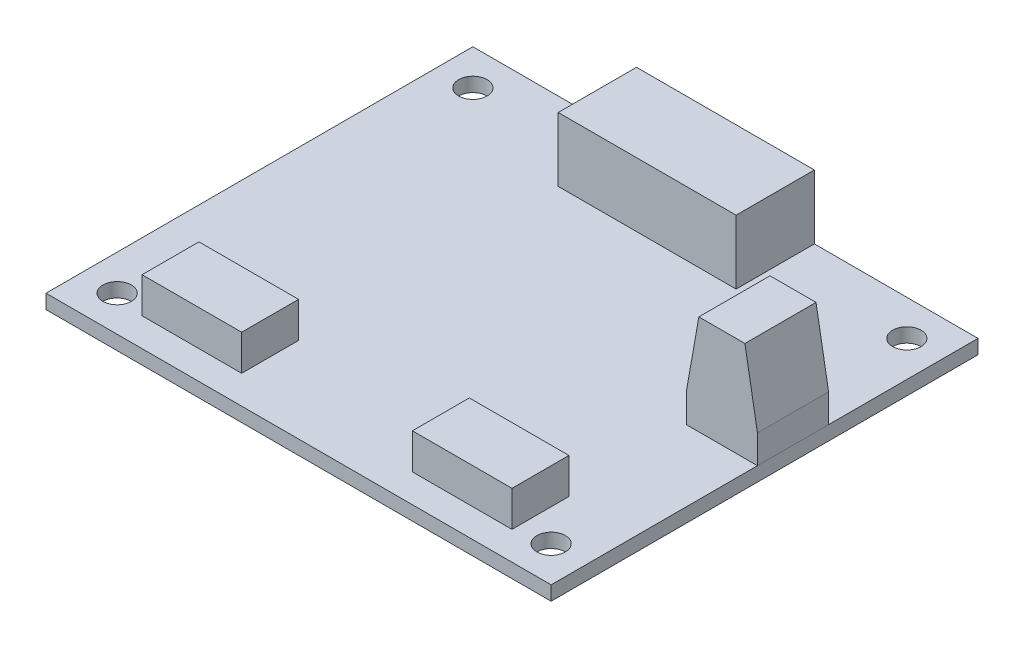
ISO-10303-21;
HEADER;
FILE_DESCRIPTION(('STEP AP214'),'2;1');
FILE_NAME('part.step','',(''),(''),'','','');
FILE_SCHEMA(('AUTOMOTIVE_DESIGN { 1 0 10303 214 1 1 1 1 }'));
ENDSEC;
DATA;
#1=APPLICATION_CONTEXT('core data for automotive mechanical design processes');
#2=APPLICATION_PROTOCOL_DEFINITION('international standard','automotive_design',2000,#1);
#3=PRODUCT_CONTEXT('',#1,'mechanical');
#4=PRODUCT('Part','Part','',(#3));
#5=PRODUCT_RELATED_PRODUCT_CATEGORY('part','',(#4));
#6=PRODUCT_DEFINITION_FORMATION('','',#4);
#7=PRODUCT_DEFINITION_CONTEXT('part definition',#1,'design');
#8=PRODUCT_DEFINITION('design','',#6,#7);
#9=PRODUCT_DEFINITION_SHAPE('','',#8);
#10=(LENGTH_UNIT() NAMED_UNIT(*) SI_UNIT(.MILLI.,.METRE.));
#11=(NAMED_UNIT(*) PLANE_ANGLE_UNIT() SI_UNIT($,.RADIAN.));
#12=(NAMED_UNIT(*) SI_UNIT($,.STERADIAN.) SOLID_ANGLE_UNIT());
#13=UNCERTAINTY_MEASURE_WITH_UNIT(LENGTH_MEASURE(1.E-05),#10,'distance_accuracy_value','');
#14=(GEOMETRIC_REPRESENTATION_CONTEXT(3) GLOBAL_UNCERTAINTY_ASSIGNED_CONTEXT((#13)) GLOBAL_UNIT_ASSIGNED_CONTEXT((#10,
#11,#12)) REPRESENTATION_CONTEXT('',''));
#15=CARTESIAN_POINT('',(0.,0.,0.));
#16=DIRECTION('',(0.,0.,1.));
#17=DIRECTION('',(1.,0.,0.));
#18=AXIS2_PLACEMENT_3D('',#15,#16,#17);
#19=CARTESIAN_POINT('',(0.,16.,-39.));
#20=DIRECTION('',(0.,0.,1.));
#21=DIRECTION('',(1.,0.,0.));
#22=AXIS2_PLACEMENT_3D('',#19,#20,#21);
#23=PLANE('',#22);
#24=DIRECTION('',(0.,-1.,0.));
#25=VECTOR('',#24,1.);
#26=CARTESIAN_POINT('',(61.,16.,-39.));
#27=LINE('',#26,#25);
#28=CARTESIAN_POINT('',(61.,5.99999999999979,-39.));
#29=VERTEX_POINT('',#28);
#30=CARTESIAN_POINT('',(61.,2.,-39.));
#31=VERTEX_POINT('',#30);
#32=EDGE_CURVE('E101',#29,#31,#27,.T.);
#33=ORIENTED_EDGE('',*,*,#32,.F.);
#34=DIRECTION('',(0.173648177666928,0.984807753012208,0.));
#35=VECTOR('',#34,1.);
#36=CARTESIAN_POINT('',(62.7632698070847,16.,-39.));
#37=LINE('',#36,#35);
#38=CARTESIAN_POINT('',(62.7632698070847,16.,-39.));
#39=VERTEX_POINT('',#38);
#40=EDGE_CURVE('E58',#29,#39,#37,.T.);
#41=ORIENTED_EDGE('',*,*,#40,.T.);
#42=DIRECTION('',(-1.,0.,0.));
#43=VECTOR('',#42,1.);
#44=CARTESIAN_POINT('',(0.,16.,-39.));
#45=LINE('',#44,#43);
#46=CARTESIAN_POINT('',(69.2367301929153,16.,-39.));
#47=VERTEX_POINT('',#46);
#48=EDGE_CURVE('E129',#47,#39,#45,.T.);
#49=ORIENTED_EDGE('',*,*,#48,.F.);
#50=DIRECTION('',(0.173648177666927,-0.984807753012209,0.));
#51=VECTOR('',#50,1.);
#52=CARTESIAN_POINT('',(69.2367301929153,16.,-39.));
#53=LINE('',#52,#51);
#54=CARTESIAN_POINT('',(71.,5.9999999999998,-39.));
#55=VERTEX_POINT('',#54);
#56=EDGE_CURVE('E65',#47,#55,#53,.T.);
#57=ORIENTED_EDGE('',*,*,#56,.T.);
#58=DIRECTION('',(0.,-1.,0.));
#59=VECTOR('',#58,1.);
#60=CARTESIAN_POINT('',(71.,16.,-39.));
#61=LINE('',#60,#59);
#62=CARTESIAN_POINT('',(71.,2.,-39.));
#63=VERTEX_POINT('',#62);
#64=EDGE_CURVE('E119',#55,#63,#61,.T.);
#65=ORIENTED_EDGE('',*,*,#64,.T.);
#66=DIRECTION('',(-1.,0.,0.));
#67=VECTOR('',#66,1.);
#68=CARTESIAN_POINT('',(0.,2.,-39.));
#69=LINE('',#68,#67);
#70=EDGE_CURVE('E115',#63,#31,#69,.T.);
#71=ORIENTED_EDGE('',*,*,#70,.T.);
#72=EDGE_LOOP('',(#33,#41,#49,#57,#65,#71));
#73=FACE_BOUND('',#72,.T.);
#74=ADVANCED_FACE('F50',(#73),#23,.F.);
#75=CARTESIAN_POINT('',(61.,16.,0.));
#76=DIRECTION('',(1.,0.,0.));
#77=DIRECTION('',(0.,0.,-1.));
#78=AXIS2_PLACEMENT_3D('',#75,#76,#77);
#79=PLANE('',#78);
#80=DIRECTION('',(0.,-1.,0.));
#81=VECTOR('',#80,1.);
#82=CARTESIAN_POINT('',(61.,16.,-29.));
#83=LINE('',#82,#81);
#84=CARTESIAN_POINT('',(61.,5.99999999999979,-29.));
#85=VERTEX_POINT('',#84);
#86=CARTESIAN_POINT('',(61.,2.,-29.));
#87=VERTEX_POINT('',#86);
#88=EDGE_CURVE('E109',#85,#87,#83,.T.);
#89=ORIENTED_EDGE('',*,*,#88,.F.);
#90=DIRECTION('',(0.,0.,-1.));
#91=VECTOR('',#90,1.);
#92=CARTESIAN_POINT('',(61.,5.99999999999979,-39.));
#93=LINE('',#92,#91);
#94=EDGE_CURVE('E73',#85,#29,#93,.T.);
#95=ORIENTED_EDGE('',*,*,#94,.T.);
#96=ORIENTED_EDGE('',*,*,#32,.T.);
#97=DIRECTION('',(0.,0.,1.));
#98=VECTOR('',#97,1.);
#99=CARTESIAN_POINT('',(61.,2.,0.));
#100=LINE('',#99,#98);
#101=EDGE_CURVE('E104',#31,#87,#100,.T.);
#102=ORIENTED_EDGE('',*,*,#101,.T.);
#103=EDGE_LOOP('',(#89,#95,#96,#102));
#104=FACE_BOUND('',#103,.T.);
#105=ADVANCED_FACE('F103',(#104),#79,.F.);
#106=CARTESIAN_POINT('',(0.,16.,-29.));
#107=DIRECTION('',(0.,0.,1.));
#108=DIRECTION('',(1.,0.,0.));
#109=AXIS2_PLACEMENT_3D('',#106,#107,#108);
#110=PLANE('',#109);
#111=DIRECTION('',(-1.,0.,0.));
#112=VECTOR('',#111,1.);
#113=CARTESIAN_POINT('',(0.,16.,-29.));
#114=LINE('',#113,#112);
#115=CARTESIAN_POINT('',(69.2367301929153,16.,-29.));
#116=VERTEX_POINT('',#115);
#117=CARTESIAN_POINT('',(62.7632698070847,16.,-29.));
#118=VERTEX_POINT('',#117);
#119=EDGE_CURVE('E123',#116,#118,#114,.T.);
#120=ORIENTED_EDGE('',*,*,#119,.T.);
#121=DIRECTION('',(-0.173648177666928,-0.984807753012208,0.));
#122=VECTOR('',#121,1.);
#123=CARTESIAN_POINT('',(60.8707256505986,5.26684873249676,-29.));
#124=LINE('',#123,#122);
#125=EDGE_CURVE('E141',#118,#85,#124,.T.);
#126=ORIENTED_EDGE('',*,*,#125,.T.);
#127=ORIENTED_EDGE('',*,*,#88,.T.);
#128=DIRECTION('',(-1.,0.,0.));
#129=VECTOR('',#128,1.);
#130=CARTESIAN_POINT('',(0.,2.,-29.));
#131=LINE('',#130,#129);
#132=CARTESIAN_POINT('',(71.,2.,-29.));
#133=VERTEX_POINT('',#132);
#134=EDGE_CURVE('E117',#133,#87,#131,.T.);
#135=ORIENTED_EDGE('',*,*,#134,.F.);
#136=DIRECTION('',(0.,-1.,0.));
#137=VECTOR('',#136,1.);
#138=CARTESIAN_POINT('',(71.,16.,-29.));
#139=LINE('',#138,#137);
#140=CARTESIAN_POINT('',(71.,5.9999999999998,-29.));
#141=VERTEX_POINT('',#140);
#142=EDGE_CURVE('E131',#141,#133,#139,.T.);
#143=ORIENTED_EDGE('',*,*,#142,.F.);
#144=DIRECTION('',(-0.173648177666927,0.984807753012209,0.));
#145=VECTOR('',#144,1.);
#146=CARTESIAN_POINT('',(67.1489873212715,27.8401781919905,-29.));
#147=LINE('',#146,#145);
#148=EDGE_CURVE('E139',#141,#116,#147,.T.);
#149=ORIENTED_EDGE('',*,*,#148,.T.);
#150=EDGE_LOOP('',(#120,#126,#127,#135,#143,#149));
#151=FACE_BOUND('',#150,.T.);
#152=ADVANCED_FACE('F154',(#151),#110,.T.);
#153=CARTESIAN_POINT('',(71.,16.,0.));
#154=DIRECTION('',(-1.,0.,0.));
#155=DIRECTION('',(0.,0.,1.));
#156=AXIS2_PLACEMENT_3D('',#153,#154,#155);
#157=PLANE('',#156);
#158=ORIENTED_EDGE('',*,*,#64,.F.);
#159=DIRECTION('',(0.,0.,1.));
#160=VECTOR('',#159,1.);
#161=CARTESIAN_POINT('',(71.,5.9999999999998,-29.));
#162=LINE('',#161,#160);
#163=EDGE_CURVE('E12',#55,#141,#162,.T.);
#164=ORIENTED_EDGE('',*,*,#163,.T.);
#165=ORIENTED_EDGE('',*,*,#142,.T.);
#166=DIRECTION('',(0.,0.,-1.));
#167=VECTOR('',#166,1.);
#168=CARTESIAN_POINT('',(71.,2.,0.));
#169=LINE('',#168,#167);
#170=EDGE_CURVE('E127',#133,#63,#169,.T.);
#171=ORIENTED_EDGE('',*,*,#170,.T.);
#172=EDGE_LOOP('',(#158,#164,#165,#171));
#173=FACE_BOUND('',#172,.T.);
#174=ADVANCED_FACE('F160',(#173),#157,.F.);
#175=CARTESIAN_POINT('',(0.,16.,0.));
#176=DIRECTION('',(0.,1.,0.));
#177=DIRECTION('',(0.,0.,1.));
#178=AXIS2_PLACEMENT_3D('',#175,#176,#177);
#179=PLANE('',#178);
#180=ORIENTED_EDGE('',*,*,#48,.T.);
#181=DIRECTION('',(0.,0.,1.));
#182=VECTOR('',#181,1.);
#183=CARTESIAN_POINT('',(62.7632698070847,16.,-29.));
#184=LINE('',#183,#182);
#185=EDGE_CURVE('E136',#39,#118,#184,.T.);
#186=ORIENTED_EDGE('',*,*,#185,.T.);
#187=ORIENTED_EDGE('',*,*,#119,.F.);
#188=DIRECTION('',(0.,0.,-1.));
#189=VECTOR('',#188,1.);
#190=CARTESIAN_POINT('',(69.2367301929153,16.,-39.));
#191=LINE('',#190,#189);
#192=EDGE_CURVE('E108',#116,#47,#191,.T.);
#193=ORIENTED_EDGE('',*,*,#192,.T.);
#194=EDGE_LOOP('',(#180,#186,#187,#193));
#195=FACE_BOUND('',#194,.T.);
#196=ADVANCED_FACE('F148',(#195),#179,.T.);
#197=CARTESIAN_POINT('',(0.,2.,0.));
#198=DIRECTION('',(0.,1.,0.));
#199=DIRECTION('',(0.,0.,1.));
#200=AXIS2_PLACEMENT_3D('',#197,#198,#199);
#201=PLANE('',#200);
#202=ORIENTED_EDGE('',*,*,#70,.F.);
#203=ORIENTED_EDGE('',*,*,#170,.F.);
#204=ORIENTED_EDGE('',*,*,#134,.T.);
#205=ORIENTED_EDGE('',*,*,#101,.F.);
#206=EDGE_LOOP('',(#202,#203,#204,#205));
#207=FACE_BOUND('',#206,.T.);
#208=ADVANCED_FACE('F113',(#207),#201,.F.);
#209=CARTESIAN_POINT('',(62.7632698070846,16.,0.));
#210=DIRECTION('',(-0.984807753012208,0.173648177666928,0.));
#211=DIRECTION('',(0.,0.,-1.));
#212=AXIS2_PLACEMENT_3D('',#209,#210,#211);
#213=PLANE('',#212);
#214=ORIENTED_EDGE('',*,*,#40,.F.);
#215=ORIENTED_EDGE('',*,*,#94,.F.);
#216=ORIENTED_EDGE('',*,*,#125,.F.);
#217=ORIENTED_EDGE('',*,*,#185,.F.);
#218=EDGE_LOOP('',(#214,#215,#216,#217));
#219=FACE_BOUND('',#218,.T.);
#220=ADVANCED_FACE('F152',(#219),#213,.T.);
#221=CARTESIAN_POINT('',(69.2367301929153,16.,0.));
#222=DIRECTION('',(0.984807753012209,0.173648177666927,0.));
#223=DIRECTION('',(0.,0.,1.));
#224=AXIS2_PLACEMENT_3D('',#221,#222,#223);
#225=PLANE('',#224);
#226=ORIENTED_EDGE('',*,*,#148,.F.);
#227=ORIENTED_EDGE('',*,*,#163,.F.);
#228=ORIENTED_EDGE('',*,*,#56,.F.);
#229=ORIENTED_EDGE('',*,*,#192,.F.);
#230=EDGE_LOOP('',(#226,#227,#228,#229));
#231=FACE_BOUND('',#230,.T.);
#232=ADVANCED_FACE('F52',(#231),#225,.T.);
#233=CLOSED_SHELL('',(#74,#105,#152,#174,#196,#208,#220,#232));
#234=MANIFOLD_SOLID_BREP('B2',#233);
#235=CARTESIAN_POINT('',(48.,11.,0.));
#236=DIRECTION('',(1.,0.,0.));
#237=DIRECTION('',(0.,0.,-1.));
#238=AXIS2_PLACEMENT_3D('',#235,#236,#237);
#239=PLANE('',#238);
#240=DIRECTION('',(0.,0.,1.));
#241=VECTOR('',#240,1.);
#242=CARTESIAN_POINT('',(48.,2.,0.));
#243=LINE('',#242,#241);
#244=CARTESIAN_POINT('',(48.,2.,-60.));
#245=VERTEX_POINT('',#244);
#246=CARTESIAN_POINT('',(48.,2.,-49.));
#247=VERTEX_POINT('',#246);
#248=EDGE_CURVE('E300',#245,#247,#243,.T.);
#249=ORIENTED_EDGE('',*,*,#248,.F.);
#250=DIRECTION('',(0.,-1.,0.));
#251=VECTOR('',#250,1.);
#252=CARTESIAN_POINT('',(48.,11.,-60.));
#253=LINE('',#252,#251);
#254=CARTESIAN_POINT('',(48.,11.,-60.));
#255=VERTEX_POINT('',#254);
#256=EDGE_CURVE('E48',#255,#245,#253,.T.);
#257=ORIENTED_EDGE('',*,*,#256,.F.);
#258=DIRECTION('',(0.,0.,1.));
#259=VECTOR('',#258,1.);
#260=CARTESIAN_POINT('',(48.,11.,0.));
#261=LINE('',#260,#259);
#262=CARTESIAN_POINT('',(48.,11.,-49.));
#263=VERTEX_POINT('',#262);
#264=EDGE_CURVE('E288',#255,#263,#261,.T.);
#265=ORIENTED_EDGE('',*,*,#264,.T.);
#266=DIRECTION('',(0.,-1.,0.));
#267=VECTOR('',#266,1.);
#268=CARTESIAN_POINT('',(48.,11.,-49.));
#269=LINE('',#268,#267);
#270=EDGE_CURVE('E277',#263,#247,#269,.T.);
#271=ORIENTED_EDGE('',*,*,#270,.T.);
#272=EDGE_LOOP('',(#249,#257,#265,#271));
#273=FACE_BOUND('',#272,.T.);
#274=ADVANCED_FACE('F238',(#273),#239,.T.);
#275=CARTESIAN_POINT('',(0.,11.,-60.));
#276=DIRECTION('',(0.,0.,1.));
#277=DIRECTION('',(1.,0.,0.));
#278=AXIS2_PLACEMENT_3D('',#275,#276,#277);
#279=PLANE('',#278);
#280=DIRECTION('',(-1.,0.,0.));
#281=VECTOR('',#280,1.);
#282=CARTESIAN_POINT('',(0.,2.,-60.));
#283=LINE('',#282,#281);
#284=CARTESIAN_POINT('',(23.,2.,-60.));
#285=VERTEX_POINT('',#284);
#286=EDGE_CURVE('E293',#245,#285,#283,.T.);
#287=ORIENTED_EDGE('',*,*,#286,.T.);
#288=DIRECTION('',(0.,-1.,0.));
#289=VECTOR('',#288,1.);
#290=CARTESIAN_POINT('',(23.,11.,-60.));
#291=LINE('',#290,#289);
#292=CARTESIAN_POINT('',(23.,11.,-60.));
#293=VERTEX_POINT('',#292);
#294=EDGE_CURVE('E246',#293,#285,#291,.T.);
#295=ORIENTED_EDGE('',*,*,#294,.F.);
#296=DIRECTION('',(-1.,0.,0.));
#297=VECTOR('',#296,1.);
#298=CARTESIAN_POINT('',(0.,11.,-60.));
#299=LINE('',#298,#297);
#300=EDGE_CURVE('E283',#255,#293,#299,.T.);
#301=ORIENTED_EDGE('',*,*,#300,.F.);
#302=ORIENTED_EDGE('',*,*,#256,.T.);
#303=EDGE_LOOP('',(#287,#295,#301,#302));
#304=FACE_BOUND('',#303,.T.);
#305=ADVANCED_FACE('F291',(#304),#279,.F.);
#306=CARTESIAN_POINT('',(23.,11.,0.));
#307=DIRECTION('',(1.,0.,0.));
#308=DIRECTION('',(0.,0.,-1.));
#309=AXIS2_PLACEMENT_3D('',#306,#307,#308);
#310=PLANE('',#309);
#311=DIRECTION('',(0.,0.,1.));
#312=VECTOR('',#311,1.);
#313=CARTESIAN_POINT('',(23.,2.,0.));
#314=LINE('',#313,#312);
#315=CARTESIAN_POINT('',(23.,2.,-49.));
#316=VERTEX_POINT('',#315);
#317=EDGE_CURVE('E270',#285,#316,#314,.T.);
#318=ORIENTED_EDGE('',*,*,#317,.T.);
#319=DIRECTION('',(0.,-1.,0.));
#320=VECTOR('',#319,1.);
#321=CARTESIAN_POINT('',(23.,11.,-49.));
#322=LINE('',#321,#320);
#323=CARTESIAN_POINT('',(23.,11.,-49.));
#324=VERTEX_POINT('',#323);
#325=EDGE_CURVE('E294',#324,#316,#322,.T.);
#326=ORIENTED_EDGE('',*,*,#325,.F.);
#327=DIRECTION('',(0.,0.,1.));
#328=VECTOR('',#327,1.);
#329=CARTESIAN_POINT('',(23.,11.,0.));
#330=LINE('',#329,#328);
#331=EDGE_CURVE('E287',#293,#324,#330,.T.);
#332=ORIENTED_EDGE('',*,*,#331,.F.);
#333=ORIENTED_EDGE('',*,*,#294,.T.);
#334=EDGE_LOOP('',(#318,#326,#332,#333));
#335=FACE_BOUND('',#334,.T.);
#336=ADVANCED_FACE('F295',(#335),#310,.F.);
#337=CARTESIAN_POINT('',(0.,11.,-49.));
#338=DIRECTION('',(0.,0.,-1.));
#339=DIRECTION('',(-1.,0.,0.));
#340=AXIS2_PLACEMENT_3D('',#337,#338,#339);
#341=PLANE('',#340);
#342=DIRECTION('',(1.,0.,0.));
#343=VECTOR('',#342,1.);
#344=CARTESIAN_POINT('',(0.,2.,-49.));
#345=LINE('',#344,#343);
#346=EDGE_CURVE('E305',#316,#247,#345,.T.);
#347=ORIENTED_EDGE('',*,*,#346,.T.);
#348=ORIENTED_EDGE('',*,*,#270,.F.);
#349=DIRECTION('',(1.,0.,0.));
#350=VECTOR('',#349,1.);
#351=CARTESIAN_POINT('',(0.,11.,-49.));
#352=LINE('',#351,#350);
#353=EDGE_CURVE('E254',#324,#263,#352,.T.);
#354=ORIENTED_EDGE('',*,*,#353,.F.);
#355=ORIENTED_EDGE('',*,*,#325,.T.);
#356=EDGE_LOOP('',(#347,#348,#354,#355));
#357=FACE_BOUND('',#356,.T.);
#358=ADVANCED_FACE('F310',(#357),#341,.F.);
#359=CARTESIAN_POINT('',(0.,11.,0.));
#360=DIRECTION('',(0.,1.,0.));
#361=DIRECTION('',(0.,0.,1.));
#362=AXIS2_PLACEMENT_3D('',#359,#360,#361);
#363=PLANE('',#362);
#364=ORIENTED_EDGE('',*,*,#264,.F.);
#365=ORIENTED_EDGE('',*,*,#300,.T.);
#366=ORIENTED_EDGE('',*,*,#331,.T.);
#367=ORIENTED_EDGE('',*,*,#353,.T.);
#368=EDGE_LOOP('',(#364,#365,#366,#367));
#369=FACE_BOUND('',#368,.T.);
#370=ADVANCED_FACE('F285',(#369),#363,.T.);
#371=CARTESIAN_POINT('',(0.,2.,0.));
#372=DIRECTION('',(0.,1.,0.));
#373=DIRECTION('',(0.,0.,1.));
#374=AXIS2_PLACEMENT_3D('',#371,#372,#373);
#375=PLANE('',#374);
#376=ORIENTED_EDGE('',*,*,#248,.T.);
#377=ORIENTED_EDGE('',*,*,#346,.F.);
#378=ORIENTED_EDGE('',*,*,#317,.F.);
#379=ORIENTED_EDGE('',*,*,#286,.F.);
#380=EDGE_LOOP('',(#376,#377,#378,#379));
#381=FACE_BOUND('',#380,.T.);
#382=ADVANCED_FACE('F312',(#381),#375,.F.);
#383=CLOSED_SHELL('',(#274,#305,#336,#358,#370,#382));
#384=MANIFOLD_SOLID_BREP('B6',#383);
#385=CARTESIAN_POINT('',(0.,2.,0.));
#386=DIRECTION('',(0.,-1.,0.));
#387=DIRECTION('',(0.,0.,-1.));
#388=AXIS2_PLACEMENT_3D('',#385,#386,#387);
#389=PLANE('',#388);
#390=DIRECTION('',(-1.,0.,0.));
#391=VECTOR('',#390,1.);
#392=CARTESIAN_POINT('',(0.,2.,-12.));
#393=LINE('',#392,#391);
#394=CARTESIAN_POINT('',(61.5,2.,-12.));
#395=VERTEX_POINT('',#394);
#396=CARTESIAN_POINT('',(47.5,2.,-12.));
#397=VERTEX_POINT('',#396);
#398=EDGE_CURVE('E488',#395,#397,#393,.T.);
#399=ORIENTED_EDGE('',*,*,#398,.F.);
#400=DIRECTION('',(0.,0.,1.));
#401=VECTOR('',#400,1.);
#402=CARTESIAN_POINT('',(61.5,2.,0.));
#403=LINE('',#402,#401);
#404=CARTESIAN_POINT('',(61.5,2.,-4.00000000000001));
#405=VERTEX_POINT('',#404);
#406=EDGE_CURVE('E463',#395,#405,#403,.T.);
#407=ORIENTED_EDGE('',*,*,#406,.T.);
#408=DIRECTION('',(-1.,0.,0.));
#409=VECTOR('',#408,1.);
#410=CARTESIAN_POINT('',(0.,2.,-3.99999999999999));
#411=LINE('',#410,#409);
#412=CARTESIAN_POINT('',(47.5,2.,-4.));
#413=VERTEX_POINT('',#412);
#414=EDGE_CURVE('E479',#405,#413,#411,.T.);
#415=ORIENTED_EDGE('',*,*,#414,.T.);
#416=DIRECTION('',(0.,0.,1.));
#417=VECTOR('',#416,1.);
#418=CARTESIAN_POINT('',(47.5,2.,0.));
#419=LINE('',#418,#417);
#420=EDGE_CURVE('E380',#397,#413,#419,.T.);
#421=ORIENTED_EDGE('',*,*,#420,.F.);
#422=EDGE_LOOP('',(#399,#407,#415,#421));
#423=FACE_BOUND('',#422,.T.);
#424=DIRECTION('',(1.,0.,0.));
#425=VECTOR('',#424,1.);
#426=CARTESIAN_POINT('',(0.,2.,-12.));
#427=LINE('',#426,#425);
#428=CARTESIAN_POINT('',(9.49999999999999,2.,-12.));
#429=VERTEX_POINT('',#428);
#430=CARTESIAN_POINT('',(23.5,2.,-12.));
#431=VERTEX_POINT('',#430);
#432=EDGE_CURVE('E388',#429,#431,#427,.T.);
#433=ORIENTED_EDGE('',*,*,#432,.T.);
#434=DIRECTION('',(0.,0.,1.));
#435=VECTOR('',#434,1.);
#436=CARTESIAN_POINT('',(23.5,2.,0.));
#437=LINE('',#436,#435);
#438=CARTESIAN_POINT('',(23.5,2.,-4.));
#439=VERTEX_POINT('',#438);
#440=EDGE_CURVE('E466',#431,#439,#437,.T.);
#441=ORIENTED_EDGE('',*,*,#440,.T.);
#442=DIRECTION('',(1.,0.,0.));
#443=VECTOR('',#442,1.);
#444=CARTESIAN_POINT('',(0.,2.,-4.));
#445=LINE('',#444,#443);
#446=CARTESIAN_POINT('',(9.49999999999999,2.,-4.));
#447=VERTEX_POINT('',#446);
#448=EDGE_CURVE('E499',#447,#439,#445,.T.);
#449=ORIENTED_EDGE('',*,*,#448,.F.);
#450=DIRECTION('',(0.,0.,1.));
#451=VECTOR('',#450,1.);
#452=CARTESIAN_POINT('',(9.49999999999999,2.,0.));
#453=LINE('',#452,#451);
#454=EDGE_CURVE('E509',#429,#447,#453,.T.);
#455=ORIENTED_EDGE('',*,*,#454,.F.);
#456=EDGE_LOOP('',(#433,#441,#449,#455));
#457=FACE_BOUND('',#456,.T.);
#458=CARTESIAN_POINT('',(4.99999999999999,2.,-5.));
#459=DIRECTION('',(0.,1.,0.));
#460=DIRECTION('',(0.,0.,1.));
#461=AXIS2_PLACEMENT_3D('',#458,#459,#460);
#462=CIRCLE('',#461,2.);
#463=CARTESIAN_POINT('',(4.99999999999999,2.,-3.));
#464=VERTEX_POINT('',#463);
#465=EDGE_CURVE('E525',#464,#464,#462,.T.);
#466=ORIENTED_EDGE('',*,*,#465,.F.);
#467=EDGE_LOOP('',(#466));
#468=FACE_BOUND('',#467,.T.);
#469=CARTESIAN_POINT('',(66.,2.,-55.));
#470=DIRECTION('',(0.,1.,0.));
#471=DIRECTION('',(0.,0.,1.));
#472=AXIS2_PLACEMENT_3D('',#469,#470,#471);
#473=CIRCLE('',#472,2.);
#474=CARTESIAN_POINT('',(66.,2.,-53.));
#475=VERTEX_POINT('',#474);
#476=EDGE_CURVE('E536',#475,#475,#473,.T.);
#477=ORIENTED_EDGE('',*,*,#476,.F.);
#478=EDGE_LOOP('',(#477));
#479=FACE_BOUND('',#478,.T.);
#480=CARTESIAN_POINT('',(4.99999999999999,2.,-55.));
#481=DIRECTION('',(0.,1.,0.));
#482=DIRECTION('',(0.,0.,1.));
#483=AXIS2_PLACEMENT_3D('',#480,#481,#482);
#484=CIRCLE('',#483,2.);
#485=CARTESIAN_POINT('',(4.99999999999999,2.,-53.));
#486=VERTEX_POINT('',#485);
#487=EDGE_CURVE('E528',#486,#486,#484,.F.);
#488=ORIENTED_EDGE('',*,*,#487,.T.);
#489=EDGE_LOOP('',(#488));
#490=FACE_BOUND('',#489,.T.);
#491=DIRECTION('',(0.,0.,1.));
#492=VECTOR('',#491,1.);
#493=CARTESIAN_POINT('',(0.,2.,0.));
#494=LINE('',#493,#492);
#495=CARTESIAN_POINT('',(0.,2.,-60.));
#496=VERTEX_POINT('',#495);
#497=CARTESIAN_POINT('',(0.,2.,0.));
#498=VERTEX_POINT('',#497);
#499=EDGE_CURVE('E549',#496,#498,#494,.T.);
#500=ORIENTED_EDGE('',*,*,#499,.T.);
#501=DIRECTION('',(1.,0.,0.));
#502=VECTOR('',#501,1.);
#503=CARTESIAN_POINT('',(0.,2.,0.));
#504=LINE('',#503,#502);
#505=CARTESIAN_POINT('',(71.,2.,0.));
#506=VERTEX_POINT('',#505);
#507=EDGE_CURVE('E552',#498,#506,#504,.T.);
#508=ORIENTED_EDGE('',*,*,#507,.T.);
#509=DIRECTION('',(0.,0.,-1.));
#510=VECTOR('',#509,1.);
#511=CARTESIAN_POINT('',(71.,2.,0.));
#512=LINE('',#511,#510);
#513=CARTESIAN_POINT('',(71.,2.,-60.));
#514=VERTEX_POINT('',#513);
#515=EDGE_CURVE('E555',#506,#514,#512,.T.);
#516=ORIENTED_EDGE('',*,*,#515,.T.);
#517=DIRECTION('',(-1.,0.,0.));
#518=VECTOR('',#517,1.);
#519=CARTESIAN_POINT('',(0.,2.,-60.));
#520=LINE('',#519,#518);
#521=EDGE_CURVE('E557',#514,#496,#520,.T.);
#522=ORIENTED_EDGE('',*,*,#521,.T.);
#523=EDGE_LOOP('',(#500,#508,#516,#522));
#524=FACE_BOUND('',#523,.T.);
#525=CARTESIAN_POINT('',(66.,2.,-5.00000000000001));
#526=DIRECTION('',(0.,1.,0.));
#527=DIRECTION('',(0.,0.,1.));
#528=AXIS2_PLACEMENT_3D('',#525,#526,#527);
#529=CIRCLE('',#528,2.);
#530=CARTESIAN_POINT('',(66.,2.,-3.00000000000002));
#531=VERTEX_POINT('',#530);
#532=EDGE_CURVE('E533',#531,#531,#529,.F.);
#533=ORIENTED_EDGE('',*,*,#532,.T.);
#534=EDGE_LOOP('',(#533));
#535=FACE_BOUND('',#534,.T.);
#536=ADVANCED_FACE('F365',(#423,#457,#468,#479,#490,#524,#535),#389,.F.);
#537=CARTESIAN_POINT('',(0.,0.,0.));
#538=DIRECTION('',(0.,-1.,0.));
#539=DIRECTION('',(0.,0.,-1.));
#540=AXIS2_PLACEMENT_3D('',#537,#538,#539);
#541=PLANE('',#540);
#542=CARTESIAN_POINT('',(4.99999999999999,0.,-5.));
#543=DIRECTION('',(0.,-1.,0.));
#544=DIRECTION('',(0.,0.,-1.));
#545=AXIS2_PLACEMENT_3D('',#542,#543,#544);
#546=CIRCLE('',#545,2.);
#547=CARTESIAN_POINT('',(4.99999999999999,0.,-7.));
#548=VERTEX_POINT('',#547);
#549=EDGE_CURVE('E529',#548,#548,#546,.F.);
#550=ORIENTED_EDGE('',*,*,#549,.T.);
#551=EDGE_LOOP('',(#550));
#552=FACE_BOUND('',#551,.T.);
#553=DIRECTION('',(0.,0.,1.));
#554=VECTOR('',#553,1.);
#555=CARTESIAN_POINT('',(0.,0.,0.));
#556=LINE('',#555,#554);
#557=CARTESIAN_POINT('',(0.,0.,-60.));
#558=VERTEX_POINT('',#557);
#559=CARTESIAN_POINT('',(0.,0.,0.));
#560=VERTEX_POINT('',#559);
#561=EDGE_CURVE('E548',#558,#560,#556,.T.);
#562=ORIENTED_EDGE('',*,*,#561,.F.);
#563=DIRECTION('',(-1.,0.,0.));
#564=VECTOR('',#563,1.);
#565=CARTESIAN_POINT('',(0.,0.,-60.));
#566=LINE('',#565,#564);
#567=CARTESIAN_POINT('',(71.,0.,-60.));
#568=VERTEX_POINT('',#567);
#569=EDGE_CURVE('E553',#568,#558,#566,.T.);
#570=ORIENTED_EDGE('',*,*,#569,.F.);
#571=DIRECTION('',(0.,0.,-1.));
#572=VECTOR('',#571,1.);
#573=CARTESIAN_POINT('',(71.,0.,0.));
#574=LINE('',#573,#572);
#575=CARTESIAN_POINT('',(71.,0.,0.));
#576=VERTEX_POINT('',#575);
#577=EDGE_CURVE('E564',#576,#568,#574,.T.);
#578=ORIENTED_EDGE('',*,*,#577,.F.);
#579=DIRECTION('',(1.,0.,0.));
#580=VECTOR('',#579,1.);
#581=CARTESIAN_POINT('',(0.,0.,0.));
#582=LINE('',#581,#580);
#583=EDGE_CURVE('E562',#560,#576,#582,.T.);
#584=ORIENTED_EDGE('',*,*,#583,.F.);
#585=EDGE_LOOP('',(#562,#570,#578,#584));
#586=FACE_BOUND('',#585,.T.);
#587=CARTESIAN_POINT('',(4.99999999999999,0.,-55.));
#588=DIRECTION('',(0.,-1.,0.));
#589=DIRECTION('',(0.,0.,-1.));
#590=AXIS2_PLACEMENT_3D('',#587,#588,#589);
#591=CIRCLE('',#590,2.);
#592=CARTESIAN_POINT('',(4.99999999999999,0.,-57.));
#593=VERTEX_POINT('',#592);
#594=EDGE_CURVE('E545',#593,#593,#591,.T.);
#595=ORIENTED_EDGE('',*,*,#594,.F.);
#596=EDGE_LOOP('',(#595));
#597=FACE_BOUND('',#596,.T.);
#598=CARTESIAN_POINT('',(66.,0.,-55.));
#599=DIRECTION('',(0.,-1.,0.));
#600=DIRECTION('',(0.,0.,-1.));
#601=AXIS2_PLACEMENT_3D('',#598,#599,#600);
#602=CIRCLE('',#601,2.);
#603=CARTESIAN_POINT('',(66.,0.,-57.));
#604=VERTEX_POINT('',#603);
#605=EDGE_CURVE('E524',#604,#604,#602,.F.);
#606=ORIENTED_EDGE('',*,*,#605,.T.);
#607=EDGE_LOOP('',(#606));
#608=FACE_BOUND('',#607,.T.);
#609=CARTESIAN_POINT('',(66.,0.,-5.00000000000001));
#610=DIRECTION('',(0.,-1.,0.));
#611=DIRECTION('',(0.,0.,-1.));
#612=AXIS2_PLACEMENT_3D('',#609,#610,#611);
#613=CIRCLE('',#612,2.);
#614=CARTESIAN_POINT('',(66.,0.,-7.00000000000001));
#615=VERTEX_POINT('',#614);
#616=EDGE_CURVE('E532',#615,#615,#613,.T.);
#617=ORIENTED_EDGE('',*,*,#616,.F.);
#618=EDGE_LOOP('',(#617));
#619=FACE_BOUND('',#618,.T.);
#620=ADVANCED_FACE('F582',(#552,#586,#597,#608,#619),#541,.T.);
#621=CARTESIAN_POINT('',(0.,2.,0.));
#622=DIRECTION('',(1.,0.,0.));
#623=DIRECTION('',(0.,0.,-1.));
#624=AXIS2_PLACEMENT_3D('',#621,#622,#623);
#625=PLANE('',#624);
#626=ORIENTED_EDGE('',*,*,#561,.T.);
#627=DIRECTION('',(0.,-1.,0.));
#628=VECTOR('',#627,1.);
#629=CARTESIAN_POINT('',(0.,2.,0.));
#630=LINE('',#629,#628);
#631=EDGE_CURVE('E236',#498,#560,#630,.T.);
#632=ORIENTED_EDGE('',*,*,#631,.F.);
#633=ORIENTED_EDGE('',*,*,#499,.F.);
#634=DIRECTION('',(0.,-1.,0.));
#635=VECTOR('',#634,1.);
#636=CARTESIAN_POINT('',(0.,2.,-60.));
#637=LINE('',#636,#635);
#638=EDGE_CURVE('E559',#496,#558,#637,.T.);
#639=ORIENTED_EDGE('',*,*,#638,.T.);
#640=EDGE_LOOP('',(#626,#632,#633,#639));
#641=FACE_BOUND('',#640,.T.);
#642=ADVANCED_FACE('F367',(#641),#625,.F.);
#643=CARTESIAN_POINT('',(0.,2.,0.));
#644=DIRECTION('',(0.,0.,-1.));
#645=DIRECTION('',(-1.,0.,0.));
#646=AXIS2_PLACEMENT_3D('',#643,#644,#645);
#647=PLANE('',#646);
#648=ORIENTED_EDGE('',*,*,#583,.T.);
#649=DIRECTION('',(0.,-1.,0.));
#650=VECTOR('',#649,1.);
#651=CARTESIAN_POINT('',(71.,2.,0.));
#652=LINE('',#651,#650);
#653=EDGE_CURVE('E373',#506,#576,#652,.T.);
#654=ORIENTED_EDGE('',*,*,#653,.F.);
#655=ORIENTED_EDGE('',*,*,#507,.F.);
#656=ORIENTED_EDGE('',*,*,#631,.T.);
#657=EDGE_LOOP('',(#648,#654,#655,#656));
#658=FACE_BOUND('',#657,.T.);
#659=ADVANCED_FACE('F593',(#658),#647,.F.);
#660=CARTESIAN_POINT('',(71.,2.,0.));
#661=DIRECTION('',(-1.,0.,0.));
#662=DIRECTION('',(0.,0.,1.));
#663=AXIS2_PLACEMENT_3D('',#660,#661,#662);
#664=PLANE('',#663);
#665=ORIENTED_EDGE('',*,*,#577,.T.);
#666=DIRECTION('',(0.,-1.,0.));
#667=VECTOR('',#666,1.);
#668=CARTESIAN_POINT('',(71.,2.,-60.));
#669=LINE('',#668,#667);
#670=EDGE_CURVE('E569',#514,#568,#669,.T.);
#671=ORIENTED_EDGE('',*,*,#670,.F.);
#672=ORIENTED_EDGE('',*,*,#515,.F.);
#673=ORIENTED_EDGE('',*,*,#653,.T.);
#674=EDGE_LOOP('',(#665,#671,#672,#673));
#675=FACE_BOUND('',#674,.T.);
#676=ADVANCED_FACE('F576',(#675),#664,.F.);
#677=CARTESIAN_POINT('',(0.,2.,-60.));
#678=DIRECTION('',(0.,0.,1.));
#679=DIRECTION('',(1.,0.,0.));
#680=AXIS2_PLACEMENT_3D('',#677,#678,#679);
#681=PLANE('',#680);
#682=ORIENTED_EDGE('',*,*,#569,.T.);
#683=ORIENTED_EDGE('',*,*,#638,.F.);
#684=ORIENTED_EDGE('',*,*,#521,.F.);
#685=ORIENTED_EDGE('',*,*,#670,.T.);
#686=EDGE_LOOP('',(#682,#683,#684,#685));
#687=FACE_BOUND('',#686,.T.);
#688=ADVANCED_FACE('F586',(#687),#681,.F.);
#689=CARTESIAN_POINT('',(4.99999999999999,-0.00100000000000013,-55.));
#690=DIRECTION('',(0.,1.,0.));
#691=DIRECTION('',(0.,0.,1.));
#692=AXIS2_PLACEMENT_3D('',#689,#690,#691);
#693=CYLINDRICAL_SURFACE('',#692,2.);
#694=ORIENTED_EDGE('',*,*,#594,.T.);
#695=EDGE_LOOP('',(#694));
#696=FACE_BOUND('',#695,.T.);
#697=ORIENTED_EDGE('',*,*,#487,.F.);
#698=EDGE_LOOP('',(#697));
#699=FACE_BOUND('',#698,.T.);
#700=ADVANCED_FACE('F609',(#696,#699),#693,.F.);
#701=CARTESIAN_POINT('',(66.,-0.00100000000000013,-55.));
#702=DIRECTION('',(0.,1.,0.));
#703=DIRECTION('',(0.,0.,1.));
#704=AXIS2_PLACEMENT_3D('',#701,#702,#703);
#705=CYLINDRICAL_SURFACE('',#704,2.);
#706=ORIENTED_EDGE('',*,*,#605,.F.);
#707=EDGE_LOOP('',(#706));
#708=FACE_BOUND('',#707,.T.);
#709=ORIENTED_EDGE('',*,*,#476,.T.);
#710=EDGE_LOOP('',(#709));
#711=FACE_BOUND('',#710,.T.);
#712=ADVANCED_FACE('F616',(#708,#711),#705,.F.);
#713=CARTESIAN_POINT('',(66.,-0.00100000000000013,-5.00000000000001));
#714=DIRECTION('',(0.,1.,0.));
#715=DIRECTION('',(0.,0.,1.));
#716=AXIS2_PLACEMENT_3D('',#713,#714,#715);
#717=CYLINDRICAL_SURFACE('',#716,2.);
#718=ORIENTED_EDGE('',*,*,#616,.T.);
#719=EDGE_LOOP('',(#718));
#720=FACE_BOUND('',#719,.T.);
#721=ORIENTED_EDGE('',*,*,#532,.F.);
#722=EDGE_LOOP('',(#721));
#723=FACE_BOUND('',#722,.T.);
#724=ADVANCED_FACE('F621',(#720,#723),#717,.F.);
#725=CARTESIAN_POINT('',(4.99999999999999,-0.00100000000000013,-5.));
#726=DIRECTION('',(0.,1.,0.));
#727=DIRECTION('',(0.,0.,1.));
#728=AXIS2_PLACEMENT_3D('',#725,#726,#727);
#729=CYLINDRICAL_SURFACE('',#728,2.);
#730=ORIENTED_EDGE('',*,*,#549,.F.);
#731=EDGE_LOOP('',(#730));
#732=FACE_BOUND('',#731,.T.);
#733=ORIENTED_EDGE('',*,*,#465,.T.);
#734=EDGE_LOOP('',(#733));
#735=FACE_BOUND('',#734,.T.);
#736=ADVANCED_FACE('F634',(#732,#735),#729,.F.);
#737=CARTESIAN_POINT('',(23.5,7.,0.));
#738=DIRECTION('',(1.,0.,0.));
#739=DIRECTION('',(0.,0.,-1.));
#740=AXIS2_PLACEMENT_3D('',#737,#738,#739);
#741=PLANE('',#740);
#742=ORIENTED_EDGE('',*,*,#440,.F.);
#743=DIRECTION('',(0.,-1.,0.));
#744=VECTOR('',#743,1.);
#745=CARTESIAN_POINT('',(23.5,7.,-12.));
#746=LINE('',#745,#744);
#747=CARTESIAN_POINT('',(23.5,7.,-12.));
#748=VERTEX_POINT('',#747);
#749=EDGE_CURVE('E522',#748,#431,#746,.T.);
#750=ORIENTED_EDGE('',*,*,#749,.F.);
#751=DIRECTION('',(0.,0.,1.));
#752=VECTOR('',#751,1.);
#753=CARTESIAN_POINT('',(23.5,7.,0.));
#754=LINE('',#753,#752);
#755=CARTESIAN_POINT('',(23.5,7.,-4.));
#756=VERTEX_POINT('',#755);
#757=EDGE_CURVE('E495',#748,#756,#754,.T.);
#758=ORIENTED_EDGE('',*,*,#757,.T.);
#759=DIRECTION('',(0.,-1.,0.));
#760=VECTOR('',#759,1.);
#761=CARTESIAN_POINT('',(23.5,7.,-4.));
#762=LINE('',#761,#760);
#763=EDGE_CURVE('E506',#756,#439,#762,.T.);
#764=ORIENTED_EDGE('',*,*,#763,.T.);
#765=EDGE_LOOP('',(#742,#750,#758,#764));
#766=FACE_BOUND('',#765,.T.);
#767=ADVANCED_FACE('F640',(#766),#741,.T.);
#768=CARTESIAN_POINT('',(0.,7.,-12.));
#769=DIRECTION('',(0.,0.,-1.));
#770=DIRECTION('',(-1.,0.,0.));
#771=AXIS2_PLACEMENT_3D('',#768,#769,#770);
#772=PLANE('',#771);
#773=ORIENTED_EDGE('',*,*,#432,.F.);
#774=DIRECTION('',(0.,-1.,0.));
#775=VECTOR('',#774,1.);
#776=CARTESIAN_POINT('',(9.49999999999999,7.,-12.));
#777=LINE('',#776,#775);
#778=CARTESIAN_POINT('',(9.49999999999999,7.,-12.));
#779=VERTEX_POINT('',#778);
#780=EDGE_CURVE('E519',#779,#429,#777,.T.);
#781=ORIENTED_EDGE('',*,*,#780,.F.);
#782=DIRECTION('',(1.,0.,0.));
#783=VECTOR('',#782,1.);
#784=CARTESIAN_POINT('',(0.,7.,-12.));
#785=LINE('',#784,#783);
#786=EDGE_CURVE('E498',#779,#748,#785,.T.);
#787=ORIENTED_EDGE('',*,*,#786,.T.);
#788=ORIENTED_EDGE('',*,*,#749,.T.);
#789=EDGE_LOOP('',(#773,#781,#787,#788));
#790=FACE_BOUND('',#789,.T.);
#791=ADVANCED_FACE('F646',(#790),#772,.T.);
#792=CARTESIAN_POINT('',(9.49999999999999,7.,0.));
#793=DIRECTION('',(1.,0.,0.));
#794=DIRECTION('',(0.,0.,-1.));
#795=AXIS2_PLACEMENT_3D('',#792,#793,#794);
#796=PLANE('',#795);
#797=ORIENTED_EDGE('',*,*,#454,.T.);
#798=DIRECTION('',(0.,-1.,0.));
#799=VECTOR('',#798,1.);
#800=CARTESIAN_POINT('',(9.49999999999999,7.,-4.));
#801=LINE('',#800,#799);
#802=CARTESIAN_POINT('',(9.49999999999999,7.,-4.));
#803=VERTEX_POINT('',#802);
#804=EDGE_CURVE('E516',#803,#447,#801,.T.);
#805=ORIENTED_EDGE('',*,*,#804,.F.);
#806=DIRECTION('',(0.,0.,1.));
#807=VECTOR('',#806,1.);
#808=CARTESIAN_POINT('',(9.49999999999999,7.,0.));
#809=LINE('',#808,#807);
#810=EDGE_CURVE('E502',#779,#803,#809,.T.);
#811=ORIENTED_EDGE('',*,*,#810,.F.);
#812=ORIENTED_EDGE('',*,*,#780,.T.);
#813=EDGE_LOOP('',(#797,#805,#811,#812));
#814=FACE_BOUND('',#813,.T.);
#815=ADVANCED_FACE('F650',(#814),#796,.F.);
#816=CARTESIAN_POINT('',(0.,7.,-4.));
#817=DIRECTION('',(0.,0.,-1.));
#818=DIRECTION('',(-1.,0.,0.));
#819=AXIS2_PLACEMENT_3D('',#816,#817,#818);
#820=PLANE('',#819);
#821=ORIENTED_EDGE('',*,*,#448,.T.);
#822=ORIENTED_EDGE('',*,*,#763,.F.);
#823=DIRECTION('',(1.,0.,0.));
#824=VECTOR('',#823,1.);
#825=CARTESIAN_POINT('',(0.,7.,-4.));
#826=LINE('',#825,#824);
#827=EDGE_CURVE('E504',#803,#756,#826,.T.);
#828=ORIENTED_EDGE('',*,*,#827,.F.);
#829=ORIENTED_EDGE('',*,*,#804,.T.);
#830=EDGE_LOOP('',(#821,#822,#828,#829));
#831=FACE_BOUND('',#830,.T.);
#832=ADVANCED_FACE('F654',(#831),#820,.F.);
#833=CARTESIAN_POINT('',(0.,7.,0.));
#834=DIRECTION('',(0.,1.,0.));
#835=DIRECTION('',(0.,0.,1.));
#836=AXIS2_PLACEMENT_3D('',#833,#834,#835);
#837=PLANE('',#836);
#838=ORIENTED_EDGE('',*,*,#757,.F.);
#839=ORIENTED_EDGE('',*,*,#786,.F.);
#840=ORIENTED_EDGE('',*,*,#810,.T.);
#841=ORIENTED_EDGE('',*,*,#827,.T.);
#842=EDGE_LOOP('',(#838,#839,#840,#841));
#843=FACE_BOUND('',#842,.T.);
#844=ADVANCED_FACE('F658',(#843),#837,.T.);
#845=CARTESIAN_POINT('',(61.5,7.,0.));
#846=DIRECTION('',(1.,0.,0.));
#847=DIRECTION('',(0.,0.,-1.));
#848=AXIS2_PLACEMENT_3D('',#845,#846,#847);
#849=PLANE('',#848);
#850=ORIENTED_EDGE('',*,*,#406,.F.);
#851=DIRECTION('',(0.,-1.,0.));
#852=VECTOR('',#851,1.);
#853=CARTESIAN_POINT('',(61.5,7.,-12.));
#854=LINE('',#853,#852);
#855=CARTESIAN_POINT('',(61.5,7.,-12.));
#856=VERTEX_POINT('',#855);
#857=EDGE_CURVE('E456',#856,#395,#854,.T.);
#858=ORIENTED_EDGE('',*,*,#857,.F.);
#859=DIRECTION('',(0.,0.,1.));
#860=VECTOR('',#859,1.);
#861=CARTESIAN_POINT('',(61.5,7.,0.));
#862=LINE('',#861,#860);
#863=CARTESIAN_POINT('',(61.5,7.,-4.00000000000001));
#864=VERTEX_POINT('',#863);
#865=EDGE_CURVE('E460',#856,#864,#862,.T.);
#866=ORIENTED_EDGE('',*,*,#865,.T.);
#867=DIRECTION('',(0.,-1.,0.));
#868=VECTOR('',#867,1.);
#869=CARTESIAN_POINT('',(61.5,7.,-4.00000000000001));
#870=LINE('',#869,#868);
#871=EDGE_CURVE('E486',#864,#405,#870,.T.);
#872=ORIENTED_EDGE('',*,*,#871,.T.);
#873=EDGE_LOOP('',(#850,#858,#866,#872));
#874=FACE_BOUND('',#873,.T.);
#875=ADVANCED_FACE('F458',(#874),#849,.T.);
#876=CARTESIAN_POINT('',(0.,7.,-12.));
#877=DIRECTION('',(0.,0.,1.));
#878=DIRECTION('',(1.,0.,0.));
#879=AXIS2_PLACEMENT_3D('',#876,#877,#878);
#880=PLANE('',#879);
#881=ORIENTED_EDGE('',*,*,#398,.T.);
#882=DIRECTION('',(0.,-1.,0.));
#883=VECTOR('',#882,1.);
#884=CARTESIAN_POINT('',(47.5,7.,-12.));
#885=LINE('',#884,#883);
#886=CARTESIAN_POINT('',(47.5,7.,-12.));
#887=VERTEX_POINT('',#886);
#888=EDGE_CURVE('E467',#887,#397,#885,.T.);
#889=ORIENTED_EDGE('',*,*,#888,.F.);
#890=DIRECTION('',(-1.,0.,0.));
#891=VECTOR('',#890,1.);
#892=CARTESIAN_POINT('',(0.,7.,-12.));
#893=LINE('',#892,#891);
#894=EDGE_CURVE('E470',#856,#887,#893,.T.);
#895=ORIENTED_EDGE('',*,*,#894,.F.);
#896=ORIENTED_EDGE('',*,*,#857,.T.);
#897=EDGE_LOOP('',(#881,#889,#895,#896));
#898=FACE_BOUND('',#897,.T.);
#899=ADVANCED_FACE('F471',(#898),#880,.F.);
#900=CARTESIAN_POINT('',(47.5,7.,0.));
#901=DIRECTION('',(1.,0.,0.));
#902=DIRECTION('',(0.,0.,-1.));
#903=AXIS2_PLACEMENT_3D('',#900,#901,#902);
#904=PLANE('',#903);
#905=ORIENTED_EDGE('',*,*,#420,.T.);
#906=DIRECTION('',(0.,-1.,0.));
#907=VECTOR('',#906,1.);
#908=CARTESIAN_POINT('',(47.5,7.,-4.));
#909=LINE('',#908,#907);
#910=CARTESIAN_POINT('',(47.5,7.,-4.));
#911=VERTEX_POINT('',#910);
#912=EDGE_CURVE('E492',#911,#413,#909,.T.);
#913=ORIENTED_EDGE('',*,*,#912,.F.);
#914=DIRECTION('',(0.,0.,1.));
#915=VECTOR('',#914,1.);
#916=CARTESIAN_POINT('',(47.5,7.,0.));
#917=LINE('',#916,#915);
#918=EDGE_CURVE('E474',#887,#911,#917,.T.);
#919=ORIENTED_EDGE('',*,*,#918,.F.);
#920=ORIENTED_EDGE('',*,*,#888,.T.);
#921=EDGE_LOOP('',(#905,#913,#919,#920));
#922=FACE_BOUND('',#921,.T.);
#923=ADVANCED_FACE('F667',(#922),#904,.F.);
#924=CARTESIAN_POINT('',(0.,7.,-3.99999999999999));
#925=DIRECTION('',(0.,0.,1.));
#926=DIRECTION('',(1.,0.,0.));
#927=AXIS2_PLACEMENT_3D('',#924,#925,#926);
#928=PLANE('',#927);
#929=ORIENTED_EDGE('',*,*,#414,.F.);
#930=ORIENTED_EDGE('',*,*,#871,.F.);
#931=DIRECTION('',(-1.,0.,0.));
#932=VECTOR('',#931,1.);
#933=CARTESIAN_POINT('',(0.,7.,-3.99999999999999));
#934=LINE('',#933,#932);
#935=EDGE_CURVE('E478',#864,#911,#934,.T.);
#936=ORIENTED_EDGE('',*,*,#935,.T.);
#937=ORIENTED_EDGE('',*,*,#912,.T.);
#938=EDGE_LOOP('',(#929,#930,#936,#937));
#939=FACE_BOUND('',#938,.T.);
#940=ADVANCED_FACE('F670',(#939),#928,.T.);
#941=CARTESIAN_POINT('',(0.,7.,0.));
#942=DIRECTION('',(0.,1.,0.));
#943=DIRECTION('',(0.,0.,1.));
#944=AXIS2_PLACEMENT_3D('',#941,#942,#943);
#945=PLANE('',#944);
#946=ORIENTED_EDGE('',*,*,#865,.F.);
#947=ORIENTED_EDGE('',*,*,#894,.T.);
#948=ORIENTED_EDGE('',*,*,#918,.T.);
#949=ORIENTED_EDGE('',*,*,#935,.F.);
#950=EDGE_LOOP('',(#946,#947,#948,#949));
#951=FACE_BOUND('',#950,.T.);
#952=ADVANCED_FACE('F476',(#951),#945,.T.);
#953=CLOSED_SHELL('',(#536,#620,#642,#659,#676,#688,#700,#712,#724,#736,#767,#791,#815,#832,
#844,#875,#899,#923,#940,#952));
#954=MANIFOLD_SOLID_BREP('B42',#953);
#955=ADVANCED_BREP_SHAPE_REPRESENTATION('',(#18,#234,#384,#954),#14);
#956=SHAPE_DEFINITION_REPRESENTATION(#9,#955);
ENDSEC;
END-ISO-10303-21;
